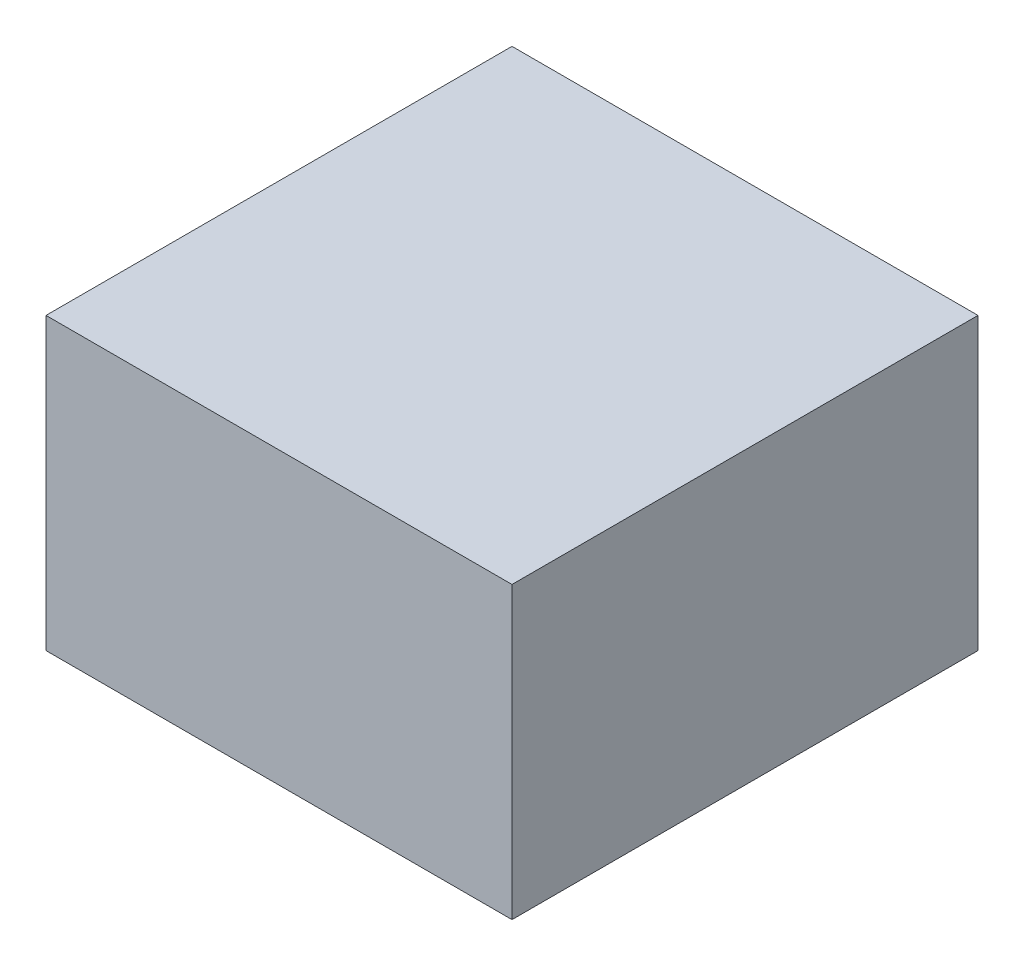
ISO-10303-21;
HEADER;
FILE_DESCRIPTION(('STEP AP214'),'2;1');
FILE_NAME('part.step','',(''),(''),'','','');
FILE_SCHEMA(('AUTOMOTIVE_DESIGN { 1 0 10303 214 1 1 1 1 }'));
ENDSEC;
DATA;
#1=APPLICATION_CONTEXT('core data for automotive mechanical design processes');
#2=APPLICATION_PROTOCOL_DEFINITION('international standard','automotive_design',2000,#1);
#3=PRODUCT_CONTEXT('',#1,'mechanical');
#4=PRODUCT('Part','Part','',(#3));
#5=PRODUCT_RELATED_PRODUCT_CATEGORY('part','',(#4));
#6=PRODUCT_DEFINITION_FORMATION('','',#4);
#7=PRODUCT_DEFINITION_CONTEXT('part definition',#1,'design');
#8=PRODUCT_DEFINITION('design','',#6,#7);
#9=PRODUCT_DEFINITION_SHAPE('','',#8);
#10=(LENGTH_UNIT() NAMED_UNIT(*) SI_UNIT(.MILLI.,.METRE.));
#11=(NAMED_UNIT(*) PLANE_ANGLE_UNIT() SI_UNIT($,.RADIAN.));
#12=(NAMED_UNIT(*) SI_UNIT($,.STERADIAN.) SOLID_ANGLE_UNIT());
#13=UNCERTAINTY_MEASURE_WITH_UNIT(LENGTH_MEASURE(1.E-05),#10,'distance_accuracy_value','');
#14=(GEOMETRIC_REPRESENTATION_CONTEXT(3) GLOBAL_UNCERTAINTY_ASSIGNED_CONTEXT((#13)) GLOBAL_UNIT_ASSIGNED_CONTEXT((#10,
#11,#12)) REPRESENTATION_CONTEXT('',''));
#15=CARTESIAN_POINT('',(0.,0.,0.));
#16=DIRECTION('',(0.,0.,1.));
#17=DIRECTION('',(1.,0.,0.));
#18=AXIS2_PLACEMENT_3D('',#15,#16,#17);
#19=CARTESIAN_POINT('',(0.,96.52,0.));
#20=DIRECTION('',(1.,0.,0.));
#21=DIRECTION('',(0.,0.,-1.));
#22=AXIS2_PLACEMENT_3D('',#19,#20,#21);
#23=PLANE('',#22);
#24=DIRECTION('',(0.,0.,1.));
#25=VECTOR('',#24,1.);
#26=CARTESIAN_POINT('',(0.,0.,0.));
#27=LINE('',#26,#25);
#28=CARTESIAN_POINT('',(0.,0.,0.));
#29=VERTEX_POINT('',#28);
#30=CARTESIAN_POINT('',(0.,0.,154.94));
#31=VERTEX_POINT('',#30);
#32=EDGE_CURVE('E96',#29,#31,#27,.T.);
#33=ORIENTED_EDGE('',*,*,#32,.T.);
#34=DIRECTION('',(0.,-1.,0.));
#35=VECTOR('',#34,1.);
#36=CARTESIAN_POINT('',(0.,96.52,154.94));
#37=LINE('',#36,#35);
#38=CARTESIAN_POINT('',(0.,96.52,154.94));
#39=VERTEX_POINT('',#38);
#40=EDGE_CURVE('E11',#39,#31,#37,.T.);
#41=ORIENTED_EDGE('',*,*,#40,.F.);
#42=DIRECTION('',(0.,0.,1.));
#43=VECTOR('',#42,1.);
#44=CARTESIAN_POINT('',(0.,96.52,0.));
#45=LINE('',#44,#43);
#46=CARTESIAN_POINT('',(0.,96.52,0.));
#47=VERTEX_POINT('',#46);
#48=EDGE_CURVE('E84',#47,#39,#45,.T.);
#49=ORIENTED_EDGE('',*,*,#48,.F.);
#50=DIRECTION('',(0.,-1.,0.));
#51=VECTOR('',#50,1.);
#52=CARTESIAN_POINT('',(0.,96.52,0.));
#53=LINE('',#52,#51);
#54=EDGE_CURVE('E92',#47,#29,#53,.T.);
#55=ORIENTED_EDGE('',*,*,#54,.T.);
#56=EDGE_LOOP('',(#33,#41,#49,#55));
#57=FACE_BOUND('',#56,.T.);
#58=ADVANCED_FACE('F33',(#57),#23,.F.);
#59=CARTESIAN_POINT('',(0.,96.52,154.94));
#60=DIRECTION('',(0.,0.,-1.));
#61=DIRECTION('',(-1.,0.,0.));
#62=AXIS2_PLACEMENT_3D('',#59,#60,#61);
#63=PLANE('',#62);
#64=DIRECTION('',(1.,0.,0.));
#65=VECTOR('',#64,1.);
#66=CARTESIAN_POINT('',(0.,0.,154.94));
#67=LINE('',#66,#65);
#68=CARTESIAN_POINT('',(154.94,0.,154.94));
#69=VERTEX_POINT('',#68);
#70=EDGE_CURVE('E88',#31,#69,#67,.T.);
#71=ORIENTED_EDGE('',*,*,#70,.T.);
#72=DIRECTION('',(0.,-1.,0.));
#73=VECTOR('',#72,1.);
#74=CARTESIAN_POINT('',(154.94,96.52,154.94));
#75=LINE('',#74,#73);
#76=CARTESIAN_POINT('',(154.94,96.52,154.94));
#77=VERTEX_POINT('',#76);
#78=EDGE_CURVE('E41',#77,#69,#75,.T.);
#79=ORIENTED_EDGE('',*,*,#78,.F.);
#80=DIRECTION('',(1.,0.,0.));
#81=VECTOR('',#80,1.);
#82=CARTESIAN_POINT('',(0.,96.52,154.94));
#83=LINE('',#82,#81);
#84=EDGE_CURVE('E79',#39,#77,#83,.T.);
#85=ORIENTED_EDGE('',*,*,#84,.F.);
#86=ORIENTED_EDGE('',*,*,#40,.T.);
#87=EDGE_LOOP('',(#71,#79,#85,#86));
#88=FACE_BOUND('',#87,.T.);
#89=ADVANCED_FACE('F87',(#88),#63,.F.);
#90=CARTESIAN_POINT('',(154.94,96.52,0.));
#91=DIRECTION('',(-1.,0.,0.));
#92=DIRECTION('',(0.,0.,1.));
#93=AXIS2_PLACEMENT_3D('',#90,#91,#92);
#94=PLANE('',#93);
#95=DIRECTION('',(0.,0.,-1.));
#96=VECTOR('',#95,1.);
#97=CARTESIAN_POINT('',(154.94,0.,0.));
#98=LINE('',#97,#96);
#99=CARTESIAN_POINT('',(154.94,0.,0.));
#100=VERTEX_POINT('',#99);
#101=EDGE_CURVE('E66',#69,#100,#98,.T.);
#102=ORIENTED_EDGE('',*,*,#101,.T.);
#103=DIRECTION('',(0.,-1.,0.));
#104=VECTOR('',#103,1.);
#105=CARTESIAN_POINT('',(154.94,96.52,0.));
#106=LINE('',#105,#104);
#107=CARTESIAN_POINT('',(154.94,96.52,0.));
#108=VERTEX_POINT('',#107);
#109=EDGE_CURVE('E89',#108,#100,#106,.T.);
#110=ORIENTED_EDGE('',*,*,#109,.F.);
#111=DIRECTION('',(0.,0.,-1.));
#112=VECTOR('',#111,1.);
#113=CARTESIAN_POINT('',(154.94,96.52,0.));
#114=LINE('',#113,#112);
#115=EDGE_CURVE('E82',#77,#108,#114,.T.);
#116=ORIENTED_EDGE('',*,*,#115,.F.);
#117=ORIENTED_EDGE('',*,*,#78,.T.);
#118=EDGE_LOOP('',(#102,#110,#116,#117));
#119=FACE_BOUND('',#118,.T.);
#120=ADVANCED_FACE('F90',(#119),#94,.F.);
#121=CARTESIAN_POINT('',(0.,96.52,0.));
#122=DIRECTION('',(0.,0.,1.));
#123=DIRECTION('',(1.,0.,0.));
#124=AXIS2_PLACEMENT_3D('',#121,#122,#123);
#125=PLANE('',#124);
#126=DIRECTION('',(-1.,0.,0.));
#127=VECTOR('',#126,1.);
#128=CARTESIAN_POINT('',(0.,0.,0.));
#129=LINE('',#128,#127);
#130=EDGE_CURVE('E72',#100,#29,#129,.T.);
#131=ORIENTED_EDGE('',*,*,#130,.T.);
#132=ORIENTED_EDGE('',*,*,#54,.F.);
#133=DIRECTION('',(-1.,0.,0.));
#134=VECTOR('',#133,1.);
#135=CARTESIAN_POINT('',(0.,96.52,0.));
#136=LINE('',#135,#134);
#137=EDGE_CURVE('E49',#108,#47,#136,.T.);
#138=ORIENTED_EDGE('',*,*,#137,.F.);
#139=ORIENTED_EDGE('',*,*,#109,.T.);
#140=EDGE_LOOP('',(#131,#132,#138,#139));
#141=FACE_BOUND('',#140,.T.);
#142=ADVANCED_FACE('F103',(#141),#125,.F.);
#143=CARTESIAN_POINT('',(0.,96.52,0.));
#144=DIRECTION('',(0.,1.,0.));
#145=DIRECTION('',(0.,0.,1.));
#146=AXIS2_PLACEMENT_3D('',#143,#144,#145);
#147=PLANE('',#146);
#148=ORIENTED_EDGE('',*,*,#48,.T.);
#149=ORIENTED_EDGE('',*,*,#84,.T.);
#150=ORIENTED_EDGE('',*,*,#115,.T.);
#151=ORIENTED_EDGE('',*,*,#137,.T.);
#152=EDGE_LOOP('',(#148,#149,#150,#151));
#153=FACE_BOUND('',#152,.T.);
#154=ADVANCED_FACE('F80',(#153),#147,.T.);
#155=CARTESIAN_POINT('',(0.,0.,0.));
#156=DIRECTION('',(0.,1.,0.));
#157=DIRECTION('',(0.,0.,1.));
#158=AXIS2_PLACEMENT_3D('',#155,#156,#157);
#159=PLANE('',#158);
#160=ORIENTED_EDGE('',*,*,#32,.F.);
#161=ORIENTED_EDGE('',*,*,#130,.F.);
#162=ORIENTED_EDGE('',*,*,#101,.F.);
#163=ORIENTED_EDGE('',*,*,#70,.F.);
#164=EDGE_LOOP('',(#160,#161,#162,#163));
#165=FACE_BOUND('',#164,.T.);
#166=ADVANCED_FACE('F106',(#165),#159,.F.);
#167=CLOSED_SHELL('',(#58,#89,#120,#142,#154,#166));
#168=MANIFOLD_SOLID_BREP('B2',#167);
#169=ADVANCED_BREP_SHAPE_REPRESENTATION('',(#18,#168),#14);
#170=SHAPE_DEFINITION_REPRESENTATION(#9,#169);
ENDSEC;
END-ISO-10303-21;
